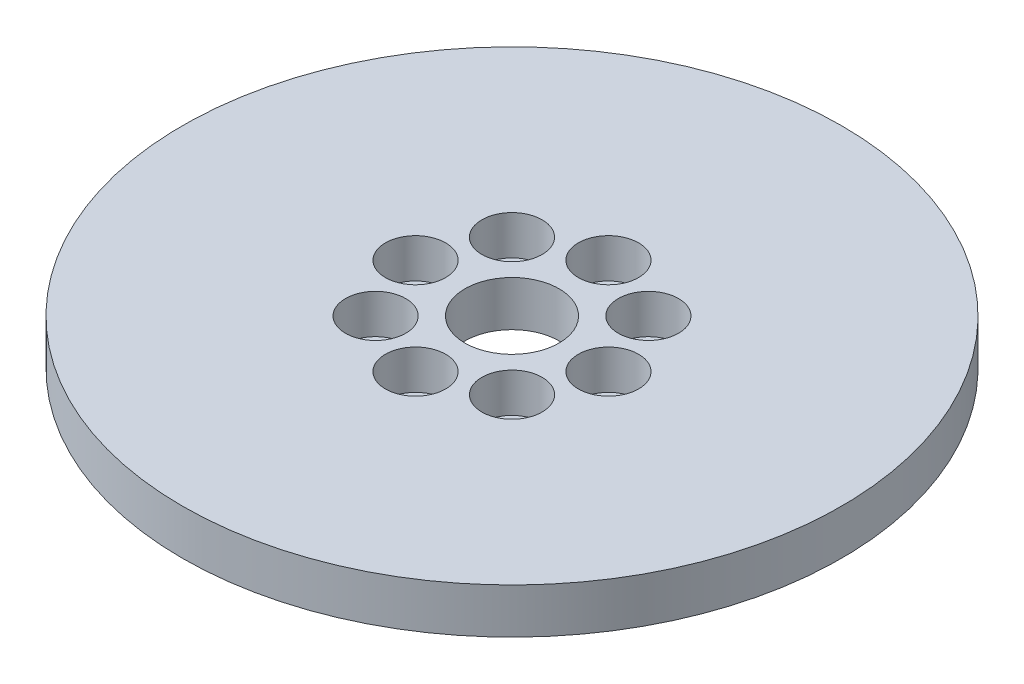
ISO-10303-21;
HEADER;
FILE_DESCRIPTION(('STEP AP214'),'2;1');
FILE_NAME('part.step','',(''),(''),'','','');
FILE_SCHEMA(('AUTOMOTIVE_DESIGN { 1 0 10303 214 1 1 1 1 }'));
ENDSEC;
DATA;
#1=APPLICATION_CONTEXT('core data for automotive mechanical design processes');
#2=APPLICATION_PROTOCOL_DEFINITION('international standard','automotive_design',2000,#1);
#3=PRODUCT_CONTEXT('',#1,'mechanical');
#4=PRODUCT('Part','Part','',(#3));
#5=PRODUCT_RELATED_PRODUCT_CATEGORY('part','',(#4));
#6=PRODUCT_DEFINITION_FORMATION('','',#4);
#7=PRODUCT_DEFINITION_CONTEXT('part definition',#1,'design');
#8=PRODUCT_DEFINITION('design','',#6,#7);
#9=PRODUCT_DEFINITION_SHAPE('','',#8);
#10=(LENGTH_UNIT() NAMED_UNIT(*) SI_UNIT(.MILLI.,.METRE.));
#11=(NAMED_UNIT(*) PLANE_ANGLE_UNIT() SI_UNIT($,.RADIAN.));
#12=(NAMED_UNIT(*) SI_UNIT($,.STERADIAN.) SOLID_ANGLE_UNIT());
#13=UNCERTAINTY_MEASURE_WITH_UNIT(LENGTH_MEASURE(1.E-05),#10,'distance_accuracy_value','');
#14=(GEOMETRIC_REPRESENTATION_CONTEXT(3) GLOBAL_UNCERTAINTY_ASSIGNED_CONTEXT((#13)) GLOBAL_UNIT_ASSIGNED_CONTEXT((#10,
#11,#12)) REPRESENTATION_CONTEXT('',''));
#15=CARTESIAN_POINT('',(0.,0.,0.));
#16=DIRECTION('',(0.,0.,1.));
#17=DIRECTION('',(1.,0.,0.));
#18=AXIS2_PLACEMENT_3D('',#15,#16,#17);
#19=CARTESIAN_POINT('',(0.,12.,0.));
#20=DIRECTION('',(0.,-1.,0.));
#21=DIRECTION('',(0.,0.,-1.));
#22=AXIS2_PLACEMENT_3D('',#19,#20,#21);
#23=CYLINDRICAL_SURFACE('',#22,87.5);
#24=CARTESIAN_POINT('',(0.,12.,0.));
#25=DIRECTION('',(0.,1.,0.));
#26=DIRECTION('',(0.,0.,1.));
#27=AXIS2_PLACEMENT_3D('',#24,#25,#26);
#28=CIRCLE('',#27,87.5);
#29=CARTESIAN_POINT('',(0.,12.,87.5));
#30=VERTEX_POINT('',#29);
#31=EDGE_CURVE('E10',#30,#30,#28,.T.);
#32=ORIENTED_EDGE('',*,*,#31,.F.);
#33=EDGE_LOOP('',(#32));
#34=FACE_BOUND('',#33,.T.);
#35=CARTESIAN_POINT('',(0.,0.,0.));
#36=DIRECTION('',(0.,1.,0.));
#37=DIRECTION('',(0.,0.,1.));
#38=AXIS2_PLACEMENT_3D('',#35,#36,#37);
#39=CIRCLE('',#38,87.5);
#40=CARTESIAN_POINT('',(0.,0.,87.5));
#41=VERTEX_POINT('',#40);
#42=EDGE_CURVE('E37',#41,#41,#39,.T.);
#43=ORIENTED_EDGE('',*,*,#42,.T.);
#44=EDGE_LOOP('',(#43));
#45=FACE_BOUND('',#44,.T.);
#46=ADVANCED_FACE('F40',(#34,#45),#23,.T.);
#47=CARTESIAN_POINT('',(0.,12.,0.));
#48=DIRECTION('',(0.,1.,0.));
#49=DIRECTION('',(0.,0.,1.));
#50=AXIS2_PLACEMENT_3D('',#47,#48,#49);
#51=PLANE('',#50);
#52=CARTESIAN_POINT('',(0.,12.,25.6104081482266));
#53=DIRECTION('',(0.,1.,0.));
#54=DIRECTION('',(1.,0.,0.));
#55=AXIS2_PLACEMENT_3D('',#52,#53,#54);
#56=CIRCLE('',#55,7.99797196786192);
#57=CARTESIAN_POINT('',(7.99797196786201,12.,25.6104081482266));
#58=VERTEX_POINT('',#57);
#59=EDGE_CURVE('E88',#58,#58,#56,.T.);
#60=ORIENTED_EDGE('',*,*,#59,.F.);
#61=EDGE_LOOP('',(#60));
#62=FACE_BOUND('',#61,.T.);
#63=CARTESIAN_POINT('',(18.1092932705663,12.,18.1092932705662));
#64=DIRECTION('',(0.,1.,0.));
#65=DIRECTION('',(0.707106781186544,0.,-0.707106781186551));
#66=AXIS2_PLACEMENT_3D('',#63,#64,#65);
#67=CIRCLE('',#66,7.99797196786192);
#68=CARTESIAN_POINT('',(23.7647134847814,12.,12.453873056351));
#69=VERTEX_POINT('',#68);
#70=EDGE_CURVE('E79',#69,#69,#67,.T.);
#71=ORIENTED_EDGE('',*,*,#70,.F.);
#72=EDGE_LOOP('',(#71));
#73=FACE_BOUND('',#72,.T.);
#74=CARTESIAN_POINT('',(25.6104081482266,12.,0.));
#75=DIRECTION('',(0.,1.,0.));
#76=DIRECTION('',(0.,0.,-1.));
#77=AXIS2_PLACEMENT_3D('',#74,#75,#76);
#78=CIRCLE('',#77,7.99797196786192);
#79=CARTESIAN_POINT('',(25.6104081482266,12.,-7.99797196786192));
#80=VERTEX_POINT('',#79);
#81=EDGE_CURVE('E74',#80,#80,#78,.T.);
#82=ORIENTED_EDGE('',*,*,#81,.F.);
#83=EDGE_LOOP('',(#82));
#84=FACE_BOUND('',#83,.T.);
#85=CARTESIAN_POINT('',(18.1092932705661,12.,-18.1092932705664));
#86=DIRECTION('',(0.,1.,0.));
#87=DIRECTION('',(-0.707106781186554,0.,-0.707106781186541));
#88=AXIS2_PLACEMENT_3D('',#85,#86,#87);
#89=CIRCLE('',#88,7.99797196786192);
#90=CARTESIAN_POINT('',(12.453873056351,12.,-23.7647134847814));
#91=VERTEX_POINT('',#90);
#92=EDGE_CURVE('E70',#91,#91,#89,.T.);
#93=ORIENTED_EDGE('',*,*,#92,.F.);
#94=EDGE_LOOP('',(#93));
#95=FACE_BOUND('',#94,.T.);
#96=CARTESIAN_POINT('',(-2.68254786389068E-13,12.,-25.6104081482266));
#97=DIRECTION('',(0.,1.,0.));
#98=DIRECTION('',(-1.,0.,0.));
#99=AXIS2_PLACEMENT_3D('',#96,#97,#98);
#100=CIRCLE('',#99,7.99797196786192);
#101=CARTESIAN_POINT('',(-7.99797196786219,12.,-25.6104081482265));
#102=VERTEX_POINT('',#101);
#103=EDGE_CURVE('E100',#102,#102,#100,.T.);
#104=ORIENTED_EDGE('',*,*,#103,.F.);
#105=EDGE_LOOP('',(#104));
#106=FACE_BOUND('',#105,.T.);
#107=CARTESIAN_POINT('',(-18.1092932705665,12.,-18.109293270566));
#108=DIRECTION('',(0.,1.,0.));
#109=DIRECTION('',(-0.707106781186539,0.,0.707106781186556));
#110=AXIS2_PLACEMENT_3D('',#107,#108,#109);
#111=CIRCLE('',#110,7.99797196786192);
#112=CARTESIAN_POINT('',(-23.7647134847815,12.,-12.4538730563509));
#113=VERTEX_POINT('',#112);
#114=EDGE_CURVE('E93',#113,#113,#111,.T.);
#115=ORIENTED_EDGE('',*,*,#114,.F.);
#116=EDGE_LOOP('',(#115));
#117=FACE_BOUND('',#116,.T.);
#118=CARTESIAN_POINT('',(-18.1092932705662,12.,18.1092932705663));
#119=DIRECTION('',(0.,1.,0.));
#120=DIRECTION('',(0.707106781186549,0.,0.707106781186546));
#121=AXIS2_PLACEMENT_3D('',#118,#119,#120);
#122=CIRCLE('',#121,7.99797196786192);
#123=CARTESIAN_POINT('',(-12.4538730563511,12.,23.7647134847814));
#124=VERTEX_POINT('',#123);
#125=EDGE_CURVE('E61',#124,#124,#122,.T.);
#126=ORIENTED_EDGE('',*,*,#125,.F.);
#127=EDGE_LOOP('',(#126));
#128=FACE_BOUND('',#127,.T.);
#129=CARTESIAN_POINT('',(-25.6104081482266,12.,0.));
#130=DIRECTION('',(0.,1.,0.));
#131=DIRECTION('',(0.,0.,1.));
#132=AXIS2_PLACEMENT_3D('',#129,#130,#131);
#133=CIRCLE('',#132,7.99797196786192);
#134=CARTESIAN_POINT('',(-25.6104081482266,12.,7.99797196786192));
#135=VERTEX_POINT('',#134);
#136=EDGE_CURVE('E54',#135,#135,#133,.T.);
#137=ORIENTED_EDGE('',*,*,#136,.F.);
#138=EDGE_LOOP('',(#137));
#139=FACE_BOUND('',#138,.T.);
#140=CARTESIAN_POINT('',(0.,12.,0.));
#141=DIRECTION('',(0.,1.,0.));
#142=DIRECTION('',(0.,0.,1.));
#143=AXIS2_PLACEMENT_3D('',#140,#141,#142);
#144=CIRCLE('',#143,12.5);
#145=CARTESIAN_POINT('',(0.,12.,12.5));
#146=VERTEX_POINT('',#145);
#147=EDGE_CURVE('E50',#146,#146,#144,.T.);
#148=ORIENTED_EDGE('',*,*,#147,.F.);
#149=EDGE_LOOP('',(#148));
#150=FACE_BOUND('',#149,.T.);
#151=ORIENTED_EDGE('',*,*,#31,.T.);
#152=EDGE_LOOP('',(#151));
#153=FACE_BOUND('',#152,.T.);
#154=ADVANCED_FACE('F115',(#62,#73,#84,#95,#106,#117,#128,#139,#150,#153),#51,.T.);
#155=CARTESIAN_POINT('',(0.,0.,0.));
#156=DIRECTION('',(0.,1.,0.));
#157=DIRECTION('',(0.,0.,1.));
#158=AXIS2_PLACEMENT_3D('',#155,#156,#157);
#159=PLANE('',#158);
#160=CARTESIAN_POINT('',(0.,0.,0.));
#161=DIRECTION('',(0.,1.,0.));
#162=DIRECTION('',(0.,0.,1.));
#163=AXIS2_PLACEMENT_3D('',#160,#161,#162);
#164=CIRCLE('',#163,12.5);
#165=CARTESIAN_POINT('',(0.,0.,12.5));
#166=VERTEX_POINT('',#165);
#167=EDGE_CURVE('E47',#166,#166,#164,.T.);
#168=ORIENTED_EDGE('',*,*,#167,.T.);
#169=EDGE_LOOP('',(#168));
#170=FACE_BOUND('',#169,.T.);
#171=ORIENTED_EDGE('',*,*,#42,.F.);
#172=EDGE_LOOP('',(#171));
#173=FACE_BOUND('',#172,.T.);
#174=ADVANCED_FACE('F113',(#170,#173),#159,.F.);
#175=CARTESIAN_POINT('',(0.,12.,0.));
#176=DIRECTION('',(0.,-1.,0.));
#177=DIRECTION('',(0.,0.,-1.));
#178=AXIS2_PLACEMENT_3D('',#175,#176,#177);
#179=CYLINDRICAL_SURFACE('',#178,12.5);
#180=ORIENTED_EDGE('',*,*,#147,.T.);
#181=EDGE_LOOP('',(#180));
#182=FACE_BOUND('',#181,.T.);
#183=ORIENTED_EDGE('',*,*,#167,.F.);
#184=EDGE_LOOP('',(#183));
#185=FACE_BOUND('',#184,.T.);
#186=ADVANCED_FACE('F127',(#182,#185),#179,.F.);
#187=CARTESIAN_POINT('',(-25.6104081482266,1.56977349186108,0.));
#188=DIRECTION('',(0.,1.,0.));
#189=DIRECTION('',(0.,0.,1.));
#190=AXIS2_PLACEMENT_3D('',#187,#188,#189);
#191=CYLINDRICAL_SURFACE('',#190,7.99797196786192);
#192=CARTESIAN_POINT('',(-25.6104081482266,1.56977349186108,0.));
#193=DIRECTION('',(0.,1.,0.));
#194=DIRECTION('',(0.,0.,1.));
#195=AXIS2_PLACEMENT_3D('',#192,#193,#194);
#196=CIRCLE('',#195,7.99797196786192);
#197=CARTESIAN_POINT('',(-25.6104081482266,1.56977349186108,7.99797196786192));
#198=VERTEX_POINT('',#197);
#199=EDGE_CURVE('E55',#198,#198,#196,.T.);
#200=ORIENTED_EDGE('',*,*,#199,.F.);
#201=EDGE_LOOP('',(#200));
#202=FACE_BOUND('',#201,.T.);
#203=ORIENTED_EDGE('',*,*,#136,.T.);
#204=EDGE_LOOP('',(#203));
#205=FACE_BOUND('',#204,.T.);
#206=ADVANCED_FACE('F129',(#202,#205),#191,.F.);
#207=CARTESIAN_POINT('',(-25.6104081482266,1.56977349186108,0.));
#208=DIRECTION('',(0.,1.,0.));
#209=DIRECTION('',(0.,0.,1.));
#210=AXIS2_PLACEMENT_3D('',#207,#208,#209);
#211=PLANE('',#210);
#212=ORIENTED_EDGE('',*,*,#199,.T.);
#213=EDGE_LOOP('',(#212));
#214=FACE_BOUND('',#213,.T.);
#215=ADVANCED_FACE('F157',(#214),#211,.T.);
#216=CARTESIAN_POINT('',(-18.1092932705662,1.56977349186108,18.1092932705663));
#217=DIRECTION('',(0.,1.,0.));
#218=DIRECTION('',(0.,0.,1.));
#219=AXIS2_PLACEMENT_3D('',#216,#217,#218);
#220=CYLINDRICAL_SURFACE('',#219,7.99797196786192);
#221=CARTESIAN_POINT('',(-18.1092932705662,1.56977349186108,18.1092932705663));
#222=DIRECTION('',(0.,1.,0.));
#223=DIRECTION('',(0.707106781186549,0.,0.707106781186546));
#224=AXIS2_PLACEMENT_3D('',#221,#222,#223);
#225=CIRCLE('',#224,7.99797196786192);
#226=CARTESIAN_POINT('',(-12.4538730563511,1.56977349186108,23.7647134847814));
#227=VERTEX_POINT('',#226);
#228=EDGE_CURVE('E59',#227,#227,#225,.T.);
#229=ORIENTED_EDGE('',*,*,#228,.F.);
#230=EDGE_LOOP('',(#229));
#231=FACE_BOUND('',#230,.T.);
#232=ORIENTED_EDGE('',*,*,#125,.T.);
#233=EDGE_LOOP('',(#232));
#234=FACE_BOUND('',#233,.T.);
#235=ADVANCED_FACE('F170',(#231,#234),#220,.F.);
#236=CARTESIAN_POINT('',(-18.1092932705662,1.56977349186108,18.1092932705663));
#237=DIRECTION('',(0.,1.,0.));
#238=DIRECTION('',(0.707106781186549,0.,0.707106781186546));
#239=AXIS2_PLACEMENT_3D('',#236,#237,#238);
#240=PLANE('',#239);
#241=ORIENTED_EDGE('',*,*,#228,.T.);
#242=EDGE_LOOP('',(#241));
#243=FACE_BOUND('',#242,.T.);
#244=ADVANCED_FACE('F182',(#243),#240,.T.);
#245=CARTESIAN_POINT('',(-18.1092932705665,1.56977349186108,-18.109293270566));
#246=DIRECTION('',(0.,1.,0.));
#247=DIRECTION('',(0.,0.,1.));
#248=AXIS2_PLACEMENT_3D('',#245,#246,#247);
#249=CYLINDRICAL_SURFACE('',#248,7.99797196786192);
#250=CARTESIAN_POINT('',(-18.1092932705665,1.56977349186108,-18.109293270566));
#251=DIRECTION('',(0.,1.,0.));
#252=DIRECTION('',(-0.707106781186539,0.,0.707106781186556));
#253=AXIS2_PLACEMENT_3D('',#250,#251,#252);
#254=CIRCLE('',#253,7.99797196786192);
#255=CARTESIAN_POINT('',(-23.7647134847815,1.56977349186108,-12.4538730563509));
#256=VERTEX_POINT('',#255);
#257=EDGE_CURVE('E94',#256,#256,#254,.T.);
#258=ORIENTED_EDGE('',*,*,#257,.F.);
#259=EDGE_LOOP('',(#258));
#260=FACE_BOUND('',#259,.T.);
#261=ORIENTED_EDGE('',*,*,#114,.T.);
#262=EDGE_LOOP('',(#261));
#263=FACE_BOUND('',#262,.T.);
#264=ADVANCED_FACE('F189',(#260,#263),#249,.F.);
#265=CARTESIAN_POINT('',(-18.1092932705665,1.56977349186108,-18.109293270566));
#266=DIRECTION('',(0.,1.,0.));
#267=DIRECTION('',(-0.707106781186539,0.,0.707106781186556));
#268=AXIS2_PLACEMENT_3D('',#265,#266,#267);
#269=PLANE('',#268);
#270=ORIENTED_EDGE('',*,*,#257,.T.);
#271=EDGE_LOOP('',(#270));
#272=FACE_BOUND('',#271,.T.);
#273=ADVANCED_FACE('F107',(#272),#269,.T.);
#274=CARTESIAN_POINT('',(-2.68254786389068E-13,1.56977349186108,-25.6104081482266));
#275=DIRECTION('',(0.,1.,0.));
#276=DIRECTION('',(0.,0.,1.));
#277=AXIS2_PLACEMENT_3D('',#274,#275,#276);
#278=CYLINDRICAL_SURFACE('',#277,7.99797196786192);
#279=CARTESIAN_POINT('',(-2.68254786389068E-13,1.56977349186108,-25.6104081482266));
#280=DIRECTION('',(0.,1.,0.));
#281=DIRECTION('',(-1.,0.,0.));
#282=AXIS2_PLACEMENT_3D('',#279,#280,#281);
#283=CIRCLE('',#282,7.99797196786192);
#284=CARTESIAN_POINT('',(-7.99797196786219,1.56977349186108,-25.6104081482265));
#285=VERTEX_POINT('',#284);
#286=EDGE_CURVE('E72',#285,#285,#283,.T.);
#287=ORIENTED_EDGE('',*,*,#286,.F.);
#288=EDGE_LOOP('',(#287));
#289=FACE_BOUND('',#288,.T.);
#290=ORIENTED_EDGE('',*,*,#103,.T.);
#291=EDGE_LOOP('',(#290));
#292=FACE_BOUND('',#291,.T.);
#293=ADVANCED_FACE('F104',(#289,#292),#278,.F.);
#294=CARTESIAN_POINT('',(-2.68254786389068E-13,1.56977349186108,-25.6104081482266));
#295=DIRECTION('',(0.,1.,0.));
#296=DIRECTION('',(-1.,0.,0.));
#297=AXIS2_PLACEMENT_3D('',#294,#295,#296);
#298=PLANE('',#297);
#299=ORIENTED_EDGE('',*,*,#286,.T.);
#300=EDGE_LOOP('',(#299));
#301=FACE_BOUND('',#300,.T.);
#302=ADVANCED_FACE('F103',(#301),#298,.T.);
#303=CARTESIAN_POINT('',(18.1092932705661,1.56977349186108,-18.1092932705664));
#304=DIRECTION('',(0.,1.,0.));
#305=DIRECTION('',(0.,0.,1.));
#306=AXIS2_PLACEMENT_3D('',#303,#304,#305);
#307=CYLINDRICAL_SURFACE('',#306,7.99797196786192);
#308=CARTESIAN_POINT('',(18.1092932705661,1.56977349186108,-18.1092932705664));
#309=DIRECTION('',(0.,1.,0.));
#310=DIRECTION('',(-0.707106781186554,0.,-0.707106781186541));
#311=AXIS2_PLACEMENT_3D('',#308,#309,#310);
#312=CIRCLE('',#311,7.99797196786192);
#313=CARTESIAN_POINT('',(12.453873056351,1.56977349186108,-23.7647134847814));
#314=VERTEX_POINT('',#313);
#315=EDGE_CURVE('E69',#314,#314,#312,.T.);
#316=ORIENTED_EDGE('',*,*,#315,.F.);
#317=EDGE_LOOP('',(#316));
#318=FACE_BOUND('',#317,.T.);
#319=ORIENTED_EDGE('',*,*,#92,.T.);
#320=EDGE_LOOP('',(#319));
#321=FACE_BOUND('',#320,.T.);
#322=ADVANCED_FACE('F219',(#318,#321),#307,.F.);
#323=CARTESIAN_POINT('',(18.1092932705661,1.56977349186108,-18.1092932705664));
#324=DIRECTION('',(0.,1.,0.));
#325=DIRECTION('',(-0.707106781186554,0.,-0.707106781186541));
#326=AXIS2_PLACEMENT_3D('',#323,#324,#325);
#327=PLANE('',#326);
#328=ORIENTED_EDGE('',*,*,#315,.T.);
#329=EDGE_LOOP('',(#328));
#330=FACE_BOUND('',#329,.T.);
#331=ADVANCED_FACE('F227',(#330),#327,.T.);
#332=CARTESIAN_POINT('',(25.6104081482266,1.56977349186108,0.));
#333=DIRECTION('',(0.,1.,0.));
#334=DIRECTION('',(0.,0.,1.));
#335=AXIS2_PLACEMENT_3D('',#332,#333,#334);
#336=CYLINDRICAL_SURFACE('',#335,7.99797196786192);
#337=CARTESIAN_POINT('',(25.6104081482266,1.56977349186108,0.));
#338=DIRECTION('',(0.,1.,0.));
#339=DIRECTION('',(0.,0.,-1.));
#340=AXIS2_PLACEMENT_3D('',#337,#338,#339);
#341=CIRCLE('',#340,7.99797196786192);
#342=CARTESIAN_POINT('',(25.6104081482266,1.56977349186108,-7.99797196786192));
#343=VERTEX_POINT('',#342);
#344=EDGE_CURVE('E80',#343,#343,#341,.T.);
#345=ORIENTED_EDGE('',*,*,#344,.F.);
#346=EDGE_LOOP('',(#345));
#347=FACE_BOUND('',#346,.T.);
#348=ORIENTED_EDGE('',*,*,#81,.T.);
#349=EDGE_LOOP('',(#348));
#350=FACE_BOUND('',#349,.T.);
#351=ADVANCED_FACE('F240',(#347,#350),#336,.F.);
#352=CARTESIAN_POINT('',(25.6104081482266,1.56977349186108,0.));
#353=DIRECTION('',(0.,1.,0.));
#354=DIRECTION('',(0.,0.,-1.));
#355=AXIS2_PLACEMENT_3D('',#352,#353,#354);
#356=PLANE('',#355);
#357=ORIENTED_EDGE('',*,*,#344,.T.);
#358=EDGE_LOOP('',(#357));
#359=FACE_BOUND('',#358,.T.);
#360=ADVANCED_FACE('F246',(#359),#356,.T.);
#361=CARTESIAN_POINT('',(18.1092932705663,1.56977349186108,18.1092932705662));
#362=DIRECTION('',(0.,1.,0.));
#363=DIRECTION('',(0.,0.,1.));
#364=AXIS2_PLACEMENT_3D('',#361,#362,#363);
#365=CYLINDRICAL_SURFACE('',#364,7.99797196786192);
#366=CARTESIAN_POINT('',(18.1092932705663,1.56977349186108,18.1092932705662));
#367=DIRECTION('',(0.,1.,0.));
#368=DIRECTION('',(0.707106781186544,0.,-0.707106781186551));
#369=AXIS2_PLACEMENT_3D('',#366,#367,#368);
#370=CIRCLE('',#369,7.99797196786192);
#371=CARTESIAN_POINT('',(23.7647134847814,1.56977349186108,12.453873056351));
#372=VERTEX_POINT('',#371);
#373=EDGE_CURVE('E82',#372,#372,#370,.T.);
#374=ORIENTED_EDGE('',*,*,#373,.F.);
#375=EDGE_LOOP('',(#374));
#376=FACE_BOUND('',#375,.T.);
#377=ORIENTED_EDGE('',*,*,#70,.T.);
#378=EDGE_LOOP('',(#377));
#379=FACE_BOUND('',#378,.T.);
#380=ADVANCED_FACE('F254',(#376,#379),#365,.F.);
#381=CARTESIAN_POINT('',(18.1092932705663,1.56977349186108,18.1092932705662));
#382=DIRECTION('',(0.,1.,0.));
#383=DIRECTION('',(0.707106781186544,0.,-0.707106781186551));
#384=AXIS2_PLACEMENT_3D('',#381,#382,#383);
#385=PLANE('',#384);
#386=ORIENTED_EDGE('',*,*,#373,.T.);
#387=EDGE_LOOP('',(#386));
#388=FACE_BOUND('',#387,.T.);
#389=ADVANCED_FACE('F262',(#388),#385,.T.);
#390=CARTESIAN_POINT('',(0.,1.56977349186108,25.6104081482266));
#391=DIRECTION('',(0.,1.,0.));
#392=DIRECTION('',(0.,0.,1.));
#393=AXIS2_PLACEMENT_3D('',#390,#391,#392);
#394=CYLINDRICAL_SURFACE('',#393,7.99797196786192);
#395=CARTESIAN_POINT('',(0.,1.56977349186108,25.6104081482266));
#396=DIRECTION('',(0.,1.,0.));
#397=DIRECTION('',(1.,0.,0.));
#398=AXIS2_PLACEMENT_3D('',#395,#396,#397);
#399=CIRCLE('',#398,7.99797196786192);
#400=CARTESIAN_POINT('',(7.99797196786201,1.56977349186108,25.6104081482266));
#401=VERTEX_POINT('',#400);
#402=EDGE_CURVE('E63',#401,#401,#399,.T.);
#403=ORIENTED_EDGE('',*,*,#402,.F.);
#404=EDGE_LOOP('',(#403));
#405=FACE_BOUND('',#404,.T.);
#406=ORIENTED_EDGE('',*,*,#59,.T.);
#407=EDGE_LOOP('',(#406));
#408=FACE_BOUND('',#407,.T.);
#409=ADVANCED_FACE('F272',(#405,#408),#394,.F.);
#410=CARTESIAN_POINT('',(0.,1.56977349186108,25.6104081482266));
#411=DIRECTION('',(0.,1.,0.));
#412=DIRECTION('',(1.,0.,0.));
#413=AXIS2_PLACEMENT_3D('',#410,#411,#412);
#414=PLANE('',#413);
#415=ORIENTED_EDGE('',*,*,#402,.T.);
#416=EDGE_LOOP('',(#415));
#417=FACE_BOUND('',#416,.T.);
#418=ADVANCED_FACE('F285',(#417),#414,.T.);
#419=CLOSED_SHELL('',(#46,#154,#174,#186,#206,#215,#235,#244,#264,#273,#293,#302,#322,#331,#351,
#360,#380,#389,#409,#418));
#420=MANIFOLD_SOLID_BREP('B2',#419);
#421=ADVANCED_BREP_SHAPE_REPRESENTATION('',(#18,#420),#14);
#422=SHAPE_DEFINITION_REPRESENTATION(#9,#421);
ENDSEC;
END-ISO-10303-21;
